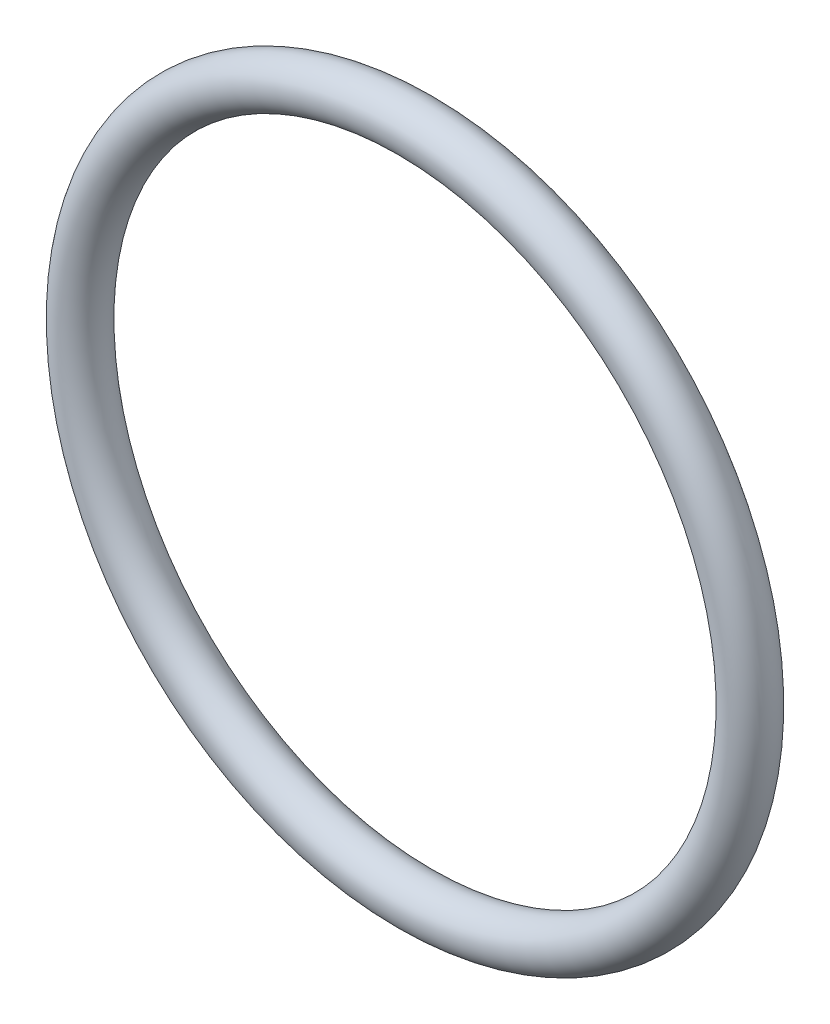
ISO-10303-21;
HEADER;
FILE_DESCRIPTION(('STEP AP214'),'2;1');
FILE_NAME('part.step','',(''),(''),'','','');
FILE_SCHEMA(('AUTOMOTIVE_DESIGN { 1 0 10303 214 1 1 1 1 }'));
ENDSEC;
DATA;
#1=APPLICATION_CONTEXT('core data for automotive mechanical design processes');
#2=APPLICATION_PROTOCOL_DEFINITION('international standard','automotive_design',2000,#1);
#3=PRODUCT_CONTEXT('',#1,'mechanical');
#4=PRODUCT('Part','Part','',(#3));
#5=PRODUCT_RELATED_PRODUCT_CATEGORY('part','',(#4));
#6=PRODUCT_DEFINITION_FORMATION('','',#4);
#7=PRODUCT_DEFINITION_CONTEXT('part definition',#1,'design');
#8=PRODUCT_DEFINITION('design','',#6,#7);
#9=PRODUCT_DEFINITION_SHAPE('','',#8);
#10=(LENGTH_UNIT() NAMED_UNIT(*) SI_UNIT(.MILLI.,.METRE.));
#11=(NAMED_UNIT(*) PLANE_ANGLE_UNIT() SI_UNIT($,.RADIAN.));
#12=(NAMED_UNIT(*) SI_UNIT($,.STERADIAN.) SOLID_ANGLE_UNIT());
#13=UNCERTAINTY_MEASURE_WITH_UNIT(LENGTH_MEASURE(1.E-05),#10,'distance_accuracy_value','');
#14=(GEOMETRIC_REPRESENTATION_CONTEXT(3) GLOBAL_UNCERTAINTY_ASSIGNED_CONTEXT((#13)) GLOBAL_UNIT_ASSIGNED_CONTEXT((#10,
#11,#12)) REPRESENTATION_CONTEXT('',''));
#15=CARTESIAN_POINT('',(0.,0.,0.));
#16=DIRECTION('',(0.,0.,1.));
#17=DIRECTION('',(1.,0.,0.));
#18=AXIS2_PLACEMENT_3D('',#15,#16,#17);
#19=CARTESIAN_POINT('',(0.,0.,0.));
#20=DIRECTION('',(0.,0.,1.));
#21=DIRECTION('',(1.,0.,0.));
#22=AXIS2_PLACEMENT_3D('',#19,#20,#21);
#23=TOROIDAL_SURFACE('',#22,28.,2.);
#24=CARTESIAN_POINT('',(0.,28.,0.));
#25=DIRECTION('',(1.,0.,0.));
#26=DIRECTION('',(0.,0.,-1.));
#27=AXIS2_PLACEMENT_3D('',#24,#25,#26);
#28=CIRCLE('',#27,2.);
#29=CARTESIAN_POINT('',(0.,30.,0.));
#30=VERTEX_POINT('',#29);
#31=EDGE_CURVE('E10',#30,#30,#28,.T.);
#32=CARTESIAN_POINT('',(0.,0.,0.));
#33=DIRECTION('',(0.,0.,1.));
#34=DIRECTION('',(1.,0.,0.));
#35=AXIS2_PLACEMENT_3D('',#32,#33,#34);
#36=CIRCLE('',#35,30.);
#37=EDGE_CURVE('',#30,#30,#36,.T.);
#38=ORIENTED_EDGE('',*,*,#31,.F.);
#39=ORIENTED_EDGE('',*,*,#31,.T.);
#40=ORIENTED_EDGE('',*,*,#37,.T.);
#41=ORIENTED_EDGE('',*,*,#37,.F.);
#42=EDGE_LOOP('',(#38,#40,#39,#41));
#43=FACE_BOUND('',#42,.T.);
#44=ADVANCED_FACE('F30',(#43),#23,.T.);
#45=CLOSED_SHELL('',(#44));
#46=MANIFOLD_SOLID_BREP('B2',#45);
#47=ADVANCED_BREP_SHAPE_REPRESENTATION('',(#18,#46),#14);
#48=SHAPE_DEFINITION_REPRESENTATION(#9,#47);
ENDSEC;
END-ISO-10303-21;
